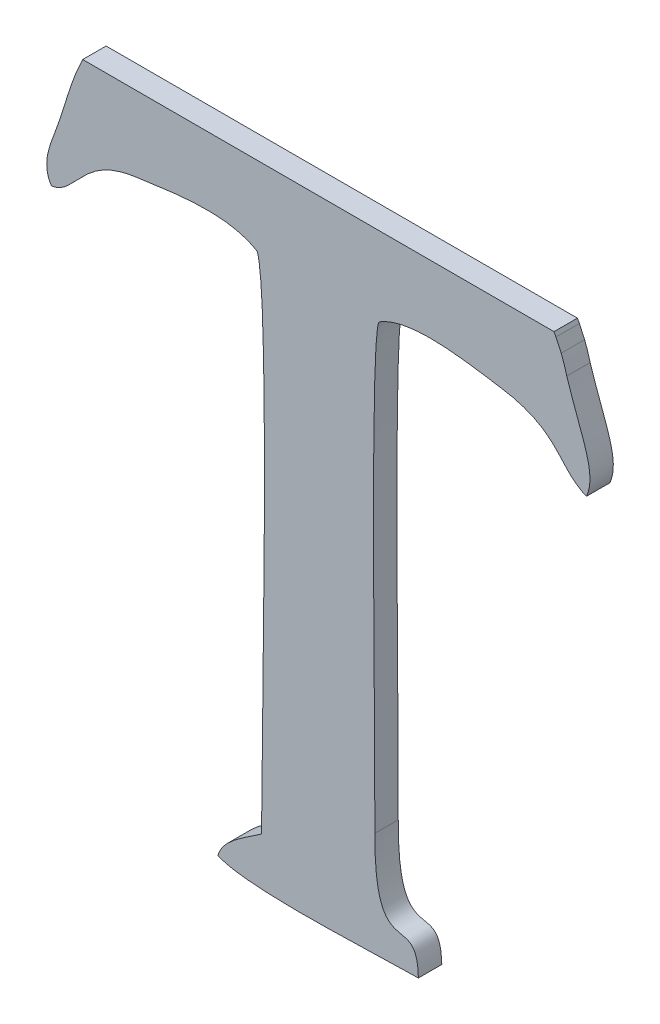
ISO-10303-21;
HEADER;
FILE_DESCRIPTION(('STEP AP214'),'2;1');
FILE_NAME('part.step','',(''),(''),'','','');
FILE_SCHEMA(('AUTOMOTIVE_DESIGN { 1 0 10303 214 1 1 1 1 }'));
ENDSEC;
DATA;
#1=APPLICATION_CONTEXT('core data for automotive mechanical design processes');
#2=APPLICATION_PROTOCOL_DEFINITION('international standard','automotive_design',2000,#1);
#3=PRODUCT_CONTEXT('',#1,'mechanical');
#4=PRODUCT('Part','Part','',(#3));
#5=PRODUCT_RELATED_PRODUCT_CATEGORY('part','',(#4));
#6=PRODUCT_DEFINITION_FORMATION('','',#4);
#7=PRODUCT_DEFINITION_CONTEXT('part definition',#1,'design');
#8=PRODUCT_DEFINITION('design','',#6,#7);
#9=PRODUCT_DEFINITION_SHAPE('','',#8);
#10=(LENGTH_UNIT() NAMED_UNIT(*) SI_UNIT(.MILLI.,.METRE.));
#11=(NAMED_UNIT(*) PLANE_ANGLE_UNIT() SI_UNIT($,.RADIAN.));
#12=(NAMED_UNIT(*) SI_UNIT($,.STERADIAN.) SOLID_ANGLE_UNIT());
#13=UNCERTAINTY_MEASURE_WITH_UNIT(LENGTH_MEASURE(1.E-05),#10,'distance_accuracy_value','');
#14=(GEOMETRIC_REPRESENTATION_CONTEXT(3) GLOBAL_UNCERTAINTY_ASSIGNED_CONTEXT((#13)) GLOBAL_UNIT_ASSIGNED_CONTEXT((#10,
#11,#12)) REPRESENTATION_CONTEXT('',''));
#15=CARTESIAN_POINT('',(0.,0.,0.));
#16=DIRECTION('',(0.,0.,1.));
#17=DIRECTION('',(1.,0.,0.));
#18=AXIS2_PLACEMENT_3D('',#15,#16,#17);
#19=CARTESIAN_POINT('',(50.1140179999998,11.257081,0.001));
#20=CARTESIAN_POINT('',(50.1140179999998,11.257081,0.));
#21=CARTESIAN_POINT('',(50.1135699999998,11.256157,0.001));
#22=CARTESIAN_POINT('',(50.1135699999998,11.256157,0.));
#23=CARTESIAN_POINT('',(50.1133739999998,11.255401,0.001));
#24=CARTESIAN_POINT('',(50.1133739999998,11.255401,0.));
#25=CARTESIAN_POINT('',(50.1130519999998,11.254407,0.001));
#26=CARTESIAN_POINT('',(50.1130519999998,11.254407,0.));
#27=B_SPLINE_SURFACE_WITH_KNOTS('',3,1,((#19,#20),(#21,#22),(#23,#24),(#25,#26)),.UNSPECIFIED.,
.F.,.F.,.F.,(4,4),(2,2),(0.823529411764706,0.882352941176471),(0.,1.),.UNSPECIFIED.);
#28=CARTESIAN_POINT('',(50.1140179999998,11.257081,0.));
#29=CARTESIAN_POINT('',(50.1135699999998,11.256157,0.));
#30=CARTESIAN_POINT('',(50.1133739999998,11.255401,0.));
#31=CARTESIAN_POINT('',(50.1130519999998,11.254407,0.));
#32=B_SPLINE_CURVE_WITH_KNOTS('',3,(#28,#29,#30,#31),.UNSPECIFIED.,.F.,.F.,(4,4),
(0.823529411764706,0.882352941176471),.UNSPECIFIED.);
#33=CARTESIAN_POINT('',(50.1140179999998,11.257081,0.));
#34=VERTEX_POINT('',#33);
#35=CARTESIAN_POINT('',(50.1130519999998,11.254407,0.));
#36=VERTEX_POINT('',#35);
#37=EDGE_CURVE('E11',#34,#36,#32,.T.);
#38=DIRECTION('',(0.,0.,-1.));
#39=VECTOR('',#38,1.);
#40=CARTESIAN_POINT('',(50.1130519999998,11.254407,0.001));
#41=LINE('',#40,#39);
#42=CARTESIAN_POINT('',(50.1130519999998,11.254407,0.001));
#43=VERTEX_POINT('',#42);
#44=EDGE_CURVE('E28',#43,#36,#41,.T.);
#45=CARTESIAN_POINT('',(50.1140179999998,11.257081,0.001));
#46=CARTESIAN_POINT('',(50.1135699999998,11.256157,0.001));
#47=CARTESIAN_POINT('',(50.1133739999998,11.255401,0.001));
#48=CARTESIAN_POINT('',(50.1130519999998,11.254407,0.001));
#49=B_SPLINE_CURVE_WITH_KNOTS('',3,(#45,#46,#47,#48),.UNSPECIFIED.,.F.,.F.,(4,4),
(0.823529411764706,0.882352941176471),.UNSPECIFIED.);
#50=CARTESIAN_POINT('',(50.1140179999998,11.257081,0.001));
#51=VERTEX_POINT('',#50);
#52=EDGE_CURVE('E368',#51,#43,#49,.T.);
#53=DIRECTION('',(0.,0.,-1.));
#54=VECTOR('',#53,1.);
#55=CARTESIAN_POINT('',(50.1140179999998,11.257081,0.001));
#56=LINE('',#55,#54);
#57=EDGE_CURVE('E40',#51,#34,#56,.T.);
#58=ORIENTED_EDGE('',*,*,#37,.T.);
#59=ORIENTED_EDGE('',*,*,#44,.F.);
#60=ORIENTED_EDGE('',*,*,#52,.F.);
#61=ORIENTED_EDGE('',*,*,#57,.T.);
#62=EDGE_LOOP('',(#58,#59,#60,#61));
#63=FACE_BOUND('',#62,.T.);
#64=ADVANCED_FACE('F17',(#63),#27,.F.);
#65=CARTESIAN_POINT('',(50.1130519999998,11.254407,0.001));
#66=CARTESIAN_POINT('',(50.1130519999998,11.254407,0.));
#67=CARTESIAN_POINT('',(50.1127859999998,11.253553,0.001));
#68=CARTESIAN_POINT('',(50.1127859999998,11.253553,0.));
#69=CARTESIAN_POINT('',(50.1121559999998,11.252503,0.001));
#70=CARTESIAN_POINT('',(50.1121559999998,11.252503,0.));
#71=CARTESIAN_POINT('',(50.1126879999998,11.251733,0.001));
#72=CARTESIAN_POINT('',(50.1126879999998,11.251733,0.));
#73=B_SPLINE_SURFACE_WITH_KNOTS('',3,1,((#65,#66),(#67,#68),(#69,#70),(#71,#72)),.UNSPECIFIED.,
.F.,.F.,.F.,(4,4),(2,2),(0.882352941176471,1.),(0.,1.),.UNSPECIFIED.);
#74=CARTESIAN_POINT('',(50.1130519999998,11.254407,0.));
#75=CARTESIAN_POINT('',(50.1127859999998,11.253553,0.));
#76=CARTESIAN_POINT('',(50.1121559999998,11.252503,0.));
#77=CARTESIAN_POINT('',(50.1126879999998,11.251733,0.));
#78=B_SPLINE_CURVE_WITH_KNOTS('',3,(#74,#75,#76,#77),.UNSPECIFIED.,.F.,.F.,(4,4),
(0.882352941176471,1.),.UNSPECIFIED.);
#79=CARTESIAN_POINT('',(50.1126879999998,11.251733,0.));
#80=VERTEX_POINT('',#79);
#81=EDGE_CURVE('E360',#36,#80,#78,.T.);
#82=DIRECTION('',(0.,0.,-1.));
#83=VECTOR('',#82,1.);
#84=CARTESIAN_POINT('',(50.1126879999998,11.251733,0.001));
#85=LINE('',#84,#83);
#86=CARTESIAN_POINT('',(50.1126879999998,11.251733,0.001));
#87=VERTEX_POINT('',#86);
#88=EDGE_CURVE('E355',#87,#80,#85,.T.);
#89=CARTESIAN_POINT('',(50.1130519999998,11.254407,0.001));
#90=CARTESIAN_POINT('',(50.1127859999998,11.253553,0.001));
#91=CARTESIAN_POINT('',(50.1121559999998,11.252503,0.001));
#92=CARTESIAN_POINT('',(50.1126879999998,11.251733,0.001));
#93=B_SPLINE_CURVE_WITH_KNOTS('',3,(#89,#90,#91,#92),.UNSPECIFIED.,.F.,.F.,(4,4),
(0.882352941176471,1.),.UNSPECIFIED.);
#94=EDGE_CURVE('E348',#43,#87,#93,.T.);
#95=ORIENTED_EDGE('',*,*,#81,.T.);
#96=ORIENTED_EDGE('',*,*,#88,.F.);
#97=ORIENTED_EDGE('',*,*,#94,.F.);
#98=ORIENTED_EDGE('',*,*,#44,.T.);
#99=EDGE_LOOP('',(#95,#96,#97,#98));
#100=FACE_BOUND('',#99,.T.);
#101=ADVANCED_FACE('F376',(#100),#73,.F.);
#102=CARTESIAN_POINT('',(50.1126879999998,11.251733,0.001));
#103=CARTESIAN_POINT('',(50.1126879999998,11.251733,0.));
#104=CARTESIAN_POINT('',(50.1137799999998,11.251915,0.001));
#105=CARTESIAN_POINT('',(50.1137799999998,11.251915,0.));
#106=CARTESIAN_POINT('',(50.1139339999998,11.253567,0.001));
#107=CARTESIAN_POINT('',(50.1139339999998,11.253567,0.));
#108=CARTESIAN_POINT('',(50.1163419999998,11.253875,0.001));
#109=CARTESIAN_POINT('',(50.1163419999998,11.253875,0.));
#110=B_SPLINE_SURFACE_WITH_KNOTS('',3,1,((#102,#103),(#104,#105),(#106,#107),(#108,#109)),
.UNSPECIFIED.,.F.,.F.,.F.,(4,4),(2,2),(0.,0.0588235294117647),(0.,1.),.UNSPECIFIED.);
#111=CARTESIAN_POINT('',(50.1126879999998,11.251733,0.));
#112=CARTESIAN_POINT('',(50.1137799999998,11.251915,0.));
#113=CARTESIAN_POINT('',(50.1139339999998,11.253567,0.));
#114=CARTESIAN_POINT('',(50.1163419999998,11.253875,0.));
#115=B_SPLINE_CURVE_WITH_KNOTS('',3,(#111,#112,#113,#114),.UNSPECIFIED.,.F.,.F.,(4,4),(0.,
0.0588235294117647),.UNSPECIFIED.);
#116=CARTESIAN_POINT('',(50.1163419999998,11.253875,0.));
#117=VERTEX_POINT('',#116);
#118=EDGE_CURVE('E343',#80,#117,#115,.T.);
#119=DIRECTION('',(0.,0.,-1.));
#120=VECTOR('',#119,1.);
#121=CARTESIAN_POINT('',(50.1163419999998,11.253875,0.001));
#122=LINE('',#121,#120);
#123=CARTESIAN_POINT('',(50.1163419999998,11.253875,0.001));
#124=VERTEX_POINT('',#123);
#125=EDGE_CURVE('E338',#124,#117,#122,.T.);
#126=CARTESIAN_POINT('',(50.1126879999998,11.251733,0.001));
#127=CARTESIAN_POINT('',(50.1137799999998,11.251915,0.001));
#128=CARTESIAN_POINT('',(50.1139339999998,11.253567,0.001));
#129=CARTESIAN_POINT('',(50.1163419999998,11.253875,0.001));
#130=B_SPLINE_CURVE_WITH_KNOTS('',3,(#126,#127,#128,#129),.UNSPECIFIED.,.F.,.F.,(4,4),(0.,
0.0588235294117647),.UNSPECIFIED.);
#131=EDGE_CURVE('E331',#87,#124,#130,.T.);
#132=ORIENTED_EDGE('',*,*,#118,.T.);
#133=ORIENTED_EDGE('',*,*,#125,.F.);
#134=ORIENTED_EDGE('',*,*,#131,.F.);
#135=ORIENTED_EDGE('',*,*,#88,.T.);
#136=EDGE_LOOP('',(#132,#133,#134,#135));
#137=FACE_BOUND('',#136,.T.);
#138=ADVANCED_FACE('F381',(#137),#110,.F.);
#139=CARTESIAN_POINT('',(50.1163419999998,11.253875,0.000999999999999998));
#140=CARTESIAN_POINT('',(50.1163419999998,11.253875,0.));
#141=CARTESIAN_POINT('',(50.1178819999998,11.254085,0.000999999999999998));
#142=CARTESIAN_POINT('',(50.1178819999998,11.254085,0.));
#143=CARTESIAN_POINT('',(50.1201919999998,11.254505,0.000999999999999998));
#144=CARTESIAN_POINT('',(50.1201919999998,11.254505,0.));
#145=CARTESIAN_POINT('',(50.1214799999998,11.253707,0.000999999999999998));
#146=CARTESIAN_POINT('',(50.1214799999998,11.253707,0.));
#147=B_SPLINE_SURFACE_WITH_KNOTS('',3,1,((#139,#140),(#141,#142),(#143,#144),(#145,#146)),
.UNSPECIFIED.,.F.,.F.,.F.,(4,4),(2,2),(0.0588235294117647,0.117647058823529),(0.,1.),.UNSPECIFIED.);
#148=CARTESIAN_POINT('',(50.1163419999998,11.253875,0.));
#149=CARTESIAN_POINT('',(50.1178819999998,11.254085,0.));
#150=CARTESIAN_POINT('',(50.1201919999998,11.254505,0.));
#151=CARTESIAN_POINT('',(50.1214799999998,11.253707,0.));
#152=B_SPLINE_CURVE_WITH_KNOTS('',3,(#148,#149,#150,#151),.UNSPECIFIED.,.F.,.F.,(4,4),
(0.0588235294117647,0.117647058823529),.UNSPECIFIED.);
#153=CARTESIAN_POINT('',(50.1214799999998,11.253707,0.));
#154=VERTEX_POINT('',#153);
#155=EDGE_CURVE('E326',#117,#154,#152,.T.);
#156=DIRECTION('',(0.,0.,-1.));
#157=VECTOR('',#156,1.);
#158=CARTESIAN_POINT('',(50.1214799999998,11.253707,0.000999999999999998));
#159=LINE('',#158,#157);
#160=CARTESIAN_POINT('',(50.1214799999998,11.253707,0.000999999999999998));
#161=VERTEX_POINT('',#160);
#162=EDGE_CURVE('E321',#161,#154,#159,.T.);
#163=CARTESIAN_POINT('',(50.1163419999998,11.253875,0.001));
#164=CARTESIAN_POINT('',(50.1178819999998,11.254085,0.000999999999999998));
#165=CARTESIAN_POINT('',(50.1201919999998,11.254505,0.000999999999999998));
#166=CARTESIAN_POINT('',(50.1214799999998,11.253707,0.000999999999999998));
#167=B_SPLINE_CURVE_WITH_KNOTS('',3,(#163,#164,#165,#166),.UNSPECIFIED.,.F.,.F.,(4,4),
(0.0588235294117647,0.117647058823529),.UNSPECIFIED.);
#168=EDGE_CURVE('E314',#124,#161,#167,.T.);
#169=ORIENTED_EDGE('',*,*,#155,.T.);
#170=ORIENTED_EDGE('',*,*,#162,.F.);
#171=ORIENTED_EDGE('',*,*,#168,.F.);
#172=ORIENTED_EDGE('',*,*,#125,.T.);
#173=EDGE_LOOP('',(#169,#170,#171,#172));
#174=FACE_BOUND('',#173,.T.);
#175=ADVANCED_FACE('F387',(#174),#147,.F.);
#176=CARTESIAN_POINT('',(50.1214799999998,11.253707,0.001));
#177=CARTESIAN_POINT('',(50.1214799999998,11.253707,0.));
#178=CARTESIAN_POINT('',(50.1220399999998,11.252223,0.001));
#179=CARTESIAN_POINT('',(50.1220399999998,11.252223,0.));
#180=CARTESIAN_POINT('',(50.1216619999998,11.235283,0.001));
#181=CARTESIAN_POINT('',(50.1216619999998,11.235283,0.));
#182=CARTESIAN_POINT('',(50.1216619999998,11.232231,0.001));
#183=CARTESIAN_POINT('',(50.1216619999998,11.232231,0.));
#184=B_SPLINE_SURFACE_WITH_KNOTS('',3,1,((#176,#177),(#178,#179),(#180,#181),(#182,#183)),
.UNSPECIFIED.,.F.,.F.,.F.,(4,4),(2,2),(0.117647058823529,0.176470588235294),(0.,1.),.UNSPECIFIED.);
#185=CARTESIAN_POINT('',(50.1214799999998,11.253707,0.));
#186=CARTESIAN_POINT('',(50.1220399999998,11.252223,0.));
#187=CARTESIAN_POINT('',(50.1216619999998,11.235283,0.));
#188=CARTESIAN_POINT('',(50.1216619999998,11.232231,0.));
#189=B_SPLINE_CURVE_WITH_KNOTS('',3,(#185,#186,#187,#188),.UNSPECIFIED.,.F.,.F.,(4,4),
(0.117647058823529,0.176470588235294),.UNSPECIFIED.);
#190=CARTESIAN_POINT('',(50.1216619999998,11.232231,0.));
#191=VERTEX_POINT('',#190);
#192=EDGE_CURVE('E309',#154,#191,#189,.T.);
#193=DIRECTION('',(0.,0.,-1.));
#194=VECTOR('',#193,1.);
#195=CARTESIAN_POINT('',(50.1216619999998,11.232231,0.001));
#196=LINE('',#195,#194);
#197=CARTESIAN_POINT('',(50.1216619999998,11.232231,0.001));
#198=VERTEX_POINT('',#197);
#199=EDGE_CURVE('E304',#198,#191,#196,.T.);
#200=CARTESIAN_POINT('',(50.1214799999998,11.253707,0.000999999999999998));
#201=CARTESIAN_POINT('',(50.1220399999998,11.252223,0.001));
#202=CARTESIAN_POINT('',(50.1216619999998,11.235283,0.001));
#203=CARTESIAN_POINT('',(50.1216619999998,11.232231,0.001));
#204=B_SPLINE_CURVE_WITH_KNOTS('',3,(#200,#201,#202,#203),.UNSPECIFIED.,.F.,.F.,(4,4),
(0.117647058823529,0.176470588235294),.UNSPECIFIED.);
#205=EDGE_CURVE('E297',#161,#198,#204,.T.);
#206=ORIENTED_EDGE('',*,*,#192,.T.);
#207=ORIENTED_EDGE('',*,*,#199,.F.);
#208=ORIENTED_EDGE('',*,*,#205,.F.);
#209=ORIENTED_EDGE('',*,*,#162,.T.);
#210=EDGE_LOOP('',(#206,#207,#208,#209));
#211=FACE_BOUND('',#210,.T.);
#212=ADVANCED_FACE('F391',(#211),#184,.F.);
#213=CARTESIAN_POINT('',(50.1216619999998,11.232231,0.001));
#214=CARTESIAN_POINT('',(50.1216619999998,11.232231,0.));
#215=CARTESIAN_POINT('',(50.1210319999998,11.231783,0.001));
#216=CARTESIAN_POINT('',(50.1210319999998,11.231783,0.));
#217=CARTESIAN_POINT('',(50.1199959999998,11.231251,0.001));
#218=CARTESIAN_POINT('',(50.1199959999998,11.231251,0.));
#219=CARTESIAN_POINT('',(50.1197999999998,11.230509,0.001));
#220=CARTESIAN_POINT('',(50.1197999999998,11.230509,0.));
#221=B_SPLINE_SURFACE_WITH_KNOTS('',3,1,((#213,#214),(#215,#216),(#217,#218),(#219,#220)),
.UNSPECIFIED.,.F.,.F.,.F.,(4,4),(2,2),(0.176470588235294,0.235294117647059),(0.,1.),.UNSPECIFIED.);
#222=CARTESIAN_POINT('',(50.1216619999998,11.232231,0.));
#223=CARTESIAN_POINT('',(50.1210319999998,11.231783,0.));
#224=CARTESIAN_POINT('',(50.1199959999998,11.231251,0.));
#225=CARTESIAN_POINT('',(50.1197999999998,11.230509,0.));
#226=B_SPLINE_CURVE_WITH_KNOTS('',3,(#222,#223,#224,#225),.UNSPECIFIED.,.F.,.F.,(4,4),
(0.176470588235294,0.235294117647059),.UNSPECIFIED.);
#227=CARTESIAN_POINT('',(50.1197999999998,11.230509,0.));
#228=VERTEX_POINT('',#227);
#229=EDGE_CURVE('E292',#191,#228,#226,.T.);
#230=DIRECTION('',(0.,0.,-1.));
#231=VECTOR('',#230,1.);
#232=CARTESIAN_POINT('',(50.1197999999998,11.230509,0.001));
#233=LINE('',#232,#231);
#234=CARTESIAN_POINT('',(50.1197999999998,11.230509,0.001));
#235=VERTEX_POINT('',#234);
#236=EDGE_CURVE('E287',#235,#228,#233,.T.);
#237=CARTESIAN_POINT('',(50.1216619999998,11.232231,0.001));
#238=CARTESIAN_POINT('',(50.1210319999998,11.231783,0.001));
#239=CARTESIAN_POINT('',(50.1199959999998,11.231251,0.001));
#240=CARTESIAN_POINT('',(50.1197999999998,11.230509,0.001));
#241=B_SPLINE_CURVE_WITH_KNOTS('',3,(#237,#238,#239,#240),.UNSPECIFIED.,.F.,.F.,(4,4),
(0.176470588235294,0.235294117647059),.UNSPECIFIED.);
#242=EDGE_CURVE('E280',#198,#235,#241,.T.);
#243=ORIENTED_EDGE('',*,*,#229,.T.);
#244=ORIENTED_EDGE('',*,*,#236,.F.);
#245=ORIENTED_EDGE('',*,*,#242,.F.);
#246=ORIENTED_EDGE('',*,*,#199,.T.);
#247=EDGE_LOOP('',(#243,#244,#245,#246));
#248=FACE_BOUND('',#247,.T.);
#249=ADVANCED_FACE('F396',(#248),#221,.F.);
#250=CARTESIAN_POINT('',(50.1197999999998,11.230509,0.001));
#251=CARTESIAN_POINT('',(50.1197999999998,11.230509,0.));
#252=CARTESIAN_POINT('',(50.1210599999998,11.229893,0.001));
#253=CARTESIAN_POINT('',(50.1210599999998,11.229893,0.));
#254=CARTESIAN_POINT('',(50.1266039999998,11.230257,0.001));
#255=CARTESIAN_POINT('',(50.1266039999998,11.230257,0.));
#256=CARTESIAN_POINT('',(50.1283679999998,11.230257,0.001));
#257=CARTESIAN_POINT('',(50.1283679999998,11.230257,0.));
#258=B_SPLINE_SURFACE_WITH_KNOTS('',3,1,((#250,#251),(#252,#253),(#254,#255),(#256,#257)),
.UNSPECIFIED.,.F.,.F.,.F.,(4,4),(2,2),(0.235294117647059,0.294117647058823),(0.,1.),.UNSPECIFIED.);
#259=CARTESIAN_POINT('',(50.1197999999998,11.230509,0.));
#260=CARTESIAN_POINT('',(50.1210599999998,11.229893,0.));
#261=CARTESIAN_POINT('',(50.1266039999998,11.230257,0.));
#262=CARTESIAN_POINT('',(50.1283679999998,11.230257,0.));
#263=B_SPLINE_CURVE_WITH_KNOTS('',3,(#259,#260,#261,#262),.UNSPECIFIED.,.F.,.F.,(4,4),
(0.235294117647059,0.294117647058823),.UNSPECIFIED.);
#264=CARTESIAN_POINT('',(50.1283679999998,11.230257,0.));
#265=VERTEX_POINT('',#264);
#266=EDGE_CURVE('E275',#228,#265,#263,.T.);
#267=DIRECTION('',(0.,0.,-1.));
#268=VECTOR('',#267,1.);
#269=CARTESIAN_POINT('',(50.1283679999998,11.230257,0.001));
#270=LINE('',#269,#268);
#271=CARTESIAN_POINT('',(50.1283679999998,11.230257,0.001));
#272=VERTEX_POINT('',#271);
#273=EDGE_CURVE('E270',#272,#265,#270,.T.);
#274=CARTESIAN_POINT('',(50.1197999999998,11.230509,0.001));
#275=CARTESIAN_POINT('',(50.1210599999998,11.229893,0.001));
#276=CARTESIAN_POINT('',(50.1266039999998,11.230257,0.001));
#277=CARTESIAN_POINT('',(50.1283679999998,11.230257,0.001));
#278=B_SPLINE_CURVE_WITH_KNOTS('',3,(#274,#275,#276,#277),.UNSPECIFIED.,.F.,.F.,(4,4),
(0.235294117647059,0.294117647058823),.UNSPECIFIED.);
#279=EDGE_CURVE('E263',#235,#272,#278,.T.);
#280=ORIENTED_EDGE('',*,*,#266,.T.);
#281=ORIENTED_EDGE('',*,*,#273,.F.);
#282=ORIENTED_EDGE('',*,*,#279,.F.);
#283=ORIENTED_EDGE('',*,*,#236,.T.);
#284=EDGE_LOOP('',(#280,#281,#282,#283));
#285=FACE_BOUND('',#284,.T.);
#286=ADVANCED_FACE('F402',(#285),#258,.F.);
#287=CARTESIAN_POINT('',(50.1283679999998,11.230257,0.001));
#288=CARTESIAN_POINT('',(50.1283679999998,11.230257,0.));
#289=CARTESIAN_POINT('',(50.1283119999998,11.232875,0.001));
#290=CARTESIAN_POINT('',(50.1283119999998,11.232875,0.));
#291=CARTESIAN_POINT('',(50.1264779999998,11.229669,0.001));
#292=CARTESIAN_POINT('',(50.1264779999998,11.229669,0.));
#293=CARTESIAN_POINT('',(50.1265059999998,11.234681,0.001));
#294=CARTESIAN_POINT('',(50.1265059999998,11.234681,0.));
#295=B_SPLINE_SURFACE_WITH_KNOTS('',3,1,((#287,#288),(#289,#290),(#291,#292),(#293,#294)),
.UNSPECIFIED.,.F.,.F.,.F.,(4,4),(2,2),(0.294117647058823,0.352941176470588),(0.,1.),.UNSPECIFIED.);
#296=CARTESIAN_POINT('',(50.1283679999998,11.230257,0.));
#297=CARTESIAN_POINT('',(50.1283119999998,11.232875,0.));
#298=CARTESIAN_POINT('',(50.1264779999998,11.229669,0.));
#299=CARTESIAN_POINT('',(50.1265059999998,11.234681,0.));
#300=B_SPLINE_CURVE_WITH_KNOTS('',3,(#296,#297,#298,#299),.UNSPECIFIED.,.F.,.F.,(4,4),
(0.294117647058823,0.352941176470588),.UNSPECIFIED.);
#301=CARTESIAN_POINT('',(50.1265059999998,11.234681,0.));
#302=VERTEX_POINT('',#301);
#303=EDGE_CURVE('E258',#265,#302,#300,.T.);
#304=DIRECTION('',(0.,0.,-1.));
#305=VECTOR('',#304,1.);
#306=CARTESIAN_POINT('',(50.1265059999998,11.234681,0.001));
#307=LINE('',#306,#305);
#308=CARTESIAN_POINT('',(50.1265059999998,11.234681,0.001));
#309=VERTEX_POINT('',#308);
#310=EDGE_CURVE('E253',#309,#302,#307,.T.);
#311=CARTESIAN_POINT('',(50.1283679999998,11.230257,0.001));
#312=CARTESIAN_POINT('',(50.1283119999998,11.232875,0.001));
#313=CARTESIAN_POINT('',(50.1264779999998,11.229669,0.001));
#314=CARTESIAN_POINT('',(50.1265059999998,11.234681,0.001));
#315=B_SPLINE_CURVE_WITH_KNOTS('',3,(#311,#312,#313,#314),.UNSPECIFIED.,.F.,.F.,(4,4),
(0.294117647058823,0.352941176470588),.UNSPECIFIED.);
#316=EDGE_CURVE('E246',#272,#309,#315,.T.);
#317=ORIENTED_EDGE('',*,*,#303,.T.);
#318=ORIENTED_EDGE('',*,*,#310,.F.);
#319=ORIENTED_EDGE('',*,*,#316,.F.);
#320=ORIENTED_EDGE('',*,*,#273,.T.);
#321=EDGE_LOOP('',(#317,#318,#319,#320));
#322=FACE_BOUND('',#321,.T.);
#323=ADVANCED_FACE('F406',(#322),#295,.F.);
#324=CARTESIAN_POINT('',(50.1265059999998,11.234681,0.001));
#325=CARTESIAN_POINT('',(50.1265059999998,11.234681,0.));
#326=CARTESIAN_POINT('',(50.1265339999998,11.237579,0.001));
#327=CARTESIAN_POINT('',(50.1265339999998,11.237579,0.));
#328=CARTESIAN_POINT('',(50.1262679999998,11.253175,0.001));
#329=CARTESIAN_POINT('',(50.1262679999998,11.253175,0.));
#330=CARTESIAN_POINT('',(50.1266879999998,11.253707,0.001));
#331=CARTESIAN_POINT('',(50.1266879999998,11.253707,0.));
#332=B_SPLINE_SURFACE_WITH_KNOTS('',3,1,((#324,#325),(#326,#327),(#328,#329),(#330,#331)),
.UNSPECIFIED.,.F.,.F.,.F.,(4,4),(2,2),(0.352941176470588,0.411764705882353),(0.,1.),.UNSPECIFIED.);
#333=CARTESIAN_POINT('',(50.1265059999998,11.234681,0.));
#334=CARTESIAN_POINT('',(50.1265339999998,11.237579,0.));
#335=CARTESIAN_POINT('',(50.1262679999998,11.253175,0.));
#336=CARTESIAN_POINT('',(50.1266879999998,11.253707,0.));
#337=B_SPLINE_CURVE_WITH_KNOTS('',3,(#333,#334,#335,#336),.UNSPECIFIED.,.F.,.F.,(4,4),
(0.352941176470588,0.411764705882353),.UNSPECIFIED.);
#338=CARTESIAN_POINT('',(50.1266879999998,11.253707,0.));
#339=VERTEX_POINT('',#338);
#340=EDGE_CURVE('E241',#302,#339,#337,.T.);
#341=DIRECTION('',(0.,0.,-1.));
#342=VECTOR('',#341,1.);
#343=CARTESIAN_POINT('',(50.1266879999998,11.253707,0.001));
#344=LINE('',#343,#342);
#345=CARTESIAN_POINT('',(50.1266879999998,11.253707,0.001));
#346=VERTEX_POINT('',#345);
#347=EDGE_CURVE('E236',#346,#339,#344,.T.);
#348=CARTESIAN_POINT('',(50.1265059999998,11.234681,0.001));
#349=CARTESIAN_POINT('',(50.1265339999998,11.237579,0.001));
#350=CARTESIAN_POINT('',(50.1262679999998,11.253175,0.001));
#351=CARTESIAN_POINT('',(50.1266879999998,11.253707,0.001));
#352=B_SPLINE_CURVE_WITH_KNOTS('',3,(#348,#349,#350,#351),.UNSPECIFIED.,.F.,.F.,(4,4),
(0.352941176470588,0.411764705882353),.UNSPECIFIED.);
#353=EDGE_CURVE('E229',#309,#346,#352,.T.);
#354=ORIENTED_EDGE('',*,*,#340,.T.);
#355=ORIENTED_EDGE('',*,*,#347,.F.);
#356=ORIENTED_EDGE('',*,*,#353,.F.);
#357=ORIENTED_EDGE('',*,*,#310,.T.);
#358=EDGE_LOOP('',(#354,#355,#356,#357));
#359=FACE_BOUND('',#358,.T.);
#360=ADVANCED_FACE('F411',(#359),#332,.F.);
#361=CARTESIAN_POINT('',(50.1266879999998,11.253707,0.000999999999999998));
#362=CARTESIAN_POINT('',(50.1266879999998,11.253707,0.));
#363=CARTESIAN_POINT('',(50.1280319999998,11.254533,0.000999999999999998));
#364=CARTESIAN_POINT('',(50.1280319999998,11.254533,0.));
#365=CARTESIAN_POINT('',(50.1302859999998,11.254113,0.000999999999999998));
#366=CARTESIAN_POINT('',(50.1302859999998,11.254113,0.));
#367=CARTESIAN_POINT('',(50.1318399999998,11.253875,0.000999999999999998));
#368=CARTESIAN_POINT('',(50.1318399999998,11.253875,0.));
#369=B_SPLINE_SURFACE_WITH_KNOTS('',3,1,((#361,#362),(#363,#364),(#365,#366),(#367,#368)),
.UNSPECIFIED.,.F.,.F.,.F.,(4,4),(2,2),(0.411764705882353,0.470588235294118),(0.,1.),.UNSPECIFIED.);
#370=CARTESIAN_POINT('',(50.1266879999998,11.253707,0.));
#371=CARTESIAN_POINT('',(50.1280319999998,11.254533,0.));
#372=CARTESIAN_POINT('',(50.1302859999998,11.254113,0.));
#373=CARTESIAN_POINT('',(50.1318399999998,11.253875,0.));
#374=B_SPLINE_CURVE_WITH_KNOTS('',3,(#370,#371,#372,#373),.UNSPECIFIED.,.F.,.F.,(4,4),
(0.411764705882353,0.470588235294118),.UNSPECIFIED.);
#375=CARTESIAN_POINT('',(50.1318399999998,11.253875,0.));
#376=VERTEX_POINT('',#375);
#377=EDGE_CURVE('E224',#339,#376,#374,.T.);
#378=DIRECTION('',(0.,0.,-1.));
#379=VECTOR('',#378,1.);
#380=CARTESIAN_POINT('',(50.1318399999998,11.253875,0.000999999999999998));
#381=LINE('',#380,#379);
#382=CARTESIAN_POINT('',(50.1318399999998,11.253875,0.000999999999999998));
#383=VERTEX_POINT('',#382);
#384=EDGE_CURVE('E219',#383,#376,#381,.T.);
#385=CARTESIAN_POINT('',(50.1266879999998,11.253707,0.001));
#386=CARTESIAN_POINT('',(50.1280319999998,11.254533,0.000999999999999998));
#387=CARTESIAN_POINT('',(50.1302859999998,11.254113,0.000999999999999998));
#388=CARTESIAN_POINT('',(50.1318399999998,11.253875,0.000999999999999998));
#389=B_SPLINE_CURVE_WITH_KNOTS('',3,(#385,#386,#387,#388),.UNSPECIFIED.,.F.,.F.,(4,4),
(0.411764705882353,0.470588235294118),.UNSPECIFIED.);
#390=EDGE_CURVE('E212',#346,#383,#389,.T.);
#391=ORIENTED_EDGE('',*,*,#377,.T.);
#392=ORIENTED_EDGE('',*,*,#384,.F.);
#393=ORIENTED_EDGE('',*,*,#390,.F.);
#394=ORIENTED_EDGE('',*,*,#347,.T.);
#395=EDGE_LOOP('',(#391,#392,#393,#394));
#396=FACE_BOUND('',#395,.T.);
#397=ADVANCED_FACE('F417',(#396),#369,.F.);
#398=CARTESIAN_POINT('',(50.1318399999998,11.253875,0.001));
#399=CARTESIAN_POINT('',(50.1318399999998,11.253875,0.));
#400=CARTESIAN_POINT('',(50.1344439999998,11.253497,0.001));
#401=CARTESIAN_POINT('',(50.1344439999998,11.253497,0.));
#402=CARTESIAN_POINT('',(50.1343039999998,11.252181,0.001));
#403=CARTESIAN_POINT('',(50.1343039999998,11.252181,0.));
#404=CARTESIAN_POINT('',(50.1355499999998,11.251677,0.001));
#405=CARTESIAN_POINT('',(50.1355499999998,11.251677,0.));
#406=B_SPLINE_SURFACE_WITH_KNOTS('',3,1,((#398,#399),(#400,#401),(#402,#403),(#404,#405)),
.UNSPECIFIED.,.F.,.F.,.F.,(4,4),(2,2),(0.470588235294118,0.529411764705882),(0.,1.),.UNSPECIFIED.);
#407=CARTESIAN_POINT('',(50.1318399999998,11.253875,0.));
#408=CARTESIAN_POINT('',(50.1344439999998,11.253497,0.));
#409=CARTESIAN_POINT('',(50.1343039999998,11.252181,0.));
#410=CARTESIAN_POINT('',(50.1355499999998,11.251677,0.));
#411=B_SPLINE_CURVE_WITH_KNOTS('',3,(#407,#408,#409,#410),.UNSPECIFIED.,.F.,.F.,(4,4),
(0.470588235294118,0.529411764705882),.UNSPECIFIED.);
#412=CARTESIAN_POINT('',(50.1355499999998,11.251677,0.));
#413=VERTEX_POINT('',#412);
#414=EDGE_CURVE('E207',#376,#413,#411,.T.);
#415=DIRECTION('',(0.,0.,-1.));
#416=VECTOR('',#415,1.);
#417=CARTESIAN_POINT('',(50.1355499999998,11.251677,0.001));
#418=LINE('',#417,#416);
#419=CARTESIAN_POINT('',(50.1355499999998,11.251677,0.001));
#420=VERTEX_POINT('',#419);
#421=EDGE_CURVE('E202',#420,#413,#418,.T.);
#422=CARTESIAN_POINT('',(50.1318399999998,11.253875,0.000999999999999998));
#423=CARTESIAN_POINT('',(50.1344439999998,11.253497,0.001));
#424=CARTESIAN_POINT('',(50.1343039999998,11.252181,0.001));
#425=CARTESIAN_POINT('',(50.1355499999998,11.251677,0.001));
#426=B_SPLINE_CURVE_WITH_KNOTS('',3,(#422,#423,#424,#425),.UNSPECIFIED.,.F.,.F.,(4,4),
(0.470588235294118,0.529411764705882),.UNSPECIFIED.);
#427=EDGE_CURVE('E195',#383,#420,#426,.T.);
#428=ORIENTED_EDGE('',*,*,#414,.T.);
#429=ORIENTED_EDGE('',*,*,#421,.F.);
#430=ORIENTED_EDGE('',*,*,#427,.F.);
#431=ORIENTED_EDGE('',*,*,#384,.T.);
#432=EDGE_LOOP('',(#428,#429,#430,#431));
#433=FACE_BOUND('',#432,.T.);
#434=ADVANCED_FACE('F421',(#433),#406,.F.);
#435=CARTESIAN_POINT('',(50.1355499999998,11.251677,0.001));
#436=CARTESIAN_POINT('',(50.1355499999998,11.251677,0.));
#437=CARTESIAN_POINT('',(50.1360119999998,11.252727,0.001));
#438=CARTESIAN_POINT('',(50.1360119999998,11.252727,0.));
#439=CARTESIAN_POINT('',(50.1352979999998,11.253819,0.001));
#440=CARTESIAN_POINT('',(50.1352979999998,11.253819,0.));
#441=CARTESIAN_POINT('',(50.1347099999998,11.255709,0.001));
#442=CARTESIAN_POINT('',(50.1347099999998,11.255709,0.));
#443=B_SPLINE_SURFACE_WITH_KNOTS('',3,1,((#435,#436),(#437,#438),(#439,#440),(#441,#442)),
.UNSPECIFIED.,.F.,.F.,.F.,(4,4),(2,2),(0.529411764705882,0.588235294117647),(0.,1.),.UNSPECIFIED.);
#444=CARTESIAN_POINT('',(50.1355499999998,11.251677,0.));
#445=CARTESIAN_POINT('',(50.1360119999998,11.252727,0.));
#446=CARTESIAN_POINT('',(50.1352979999998,11.253819,0.));
#447=CARTESIAN_POINT('',(50.1347099999998,11.255709,0.));
#448=B_SPLINE_CURVE_WITH_KNOTS('',3,(#444,#445,#446,#447),.UNSPECIFIED.,.F.,.F.,(4,4),
(0.529411764705882,0.588235294117647),.UNSPECIFIED.);
#449=CARTESIAN_POINT('',(50.1347099999998,11.255709,0.));
#450=VERTEX_POINT('',#449);
#451=EDGE_CURVE('E190',#413,#450,#448,.T.);
#452=DIRECTION('',(0.,0.,-1.));
#453=VECTOR('',#452,1.);
#454=CARTESIAN_POINT('',(50.1347099999998,11.255709,0.001));
#455=LINE('',#454,#453);
#456=CARTESIAN_POINT('',(50.1347099999998,11.255709,0.001));
#457=VERTEX_POINT('',#456);
#458=EDGE_CURVE('E185',#457,#450,#455,.T.);
#459=CARTESIAN_POINT('',(50.1355499999998,11.251677,0.001));
#460=CARTESIAN_POINT('',(50.1360119999998,11.252727,0.001));
#461=CARTESIAN_POINT('',(50.1352979999998,11.253819,0.001));
#462=CARTESIAN_POINT('',(50.1347099999998,11.255709,0.001));
#463=B_SPLINE_CURVE_WITH_KNOTS('',3,(#459,#460,#461,#462),.UNSPECIFIED.,.F.,.F.,(4,4),
(0.529411764705882,0.588235294117647),.UNSPECIFIED.);
#464=EDGE_CURVE('E178',#420,#457,#463,.T.);
#465=ORIENTED_EDGE('',*,*,#451,.T.);
#466=ORIENTED_EDGE('',*,*,#458,.F.);
#467=ORIENTED_EDGE('',*,*,#464,.F.);
#468=ORIENTED_EDGE('',*,*,#421,.T.);
#469=EDGE_LOOP('',(#465,#466,#467,#468));
#470=FACE_BOUND('',#469,.T.);
#471=ADVANCED_FACE('F426',(#470),#443,.F.);
#472=CARTESIAN_POINT('',(50.1347099999998,11.255709,0.001));
#473=CARTESIAN_POINT('',(50.1347099999998,11.255709,0.));
#474=CARTESIAN_POINT('',(50.1346399999998,11.255947,0.001));
#475=CARTESIAN_POINT('',(50.1346399999998,11.255947,0.));
#476=CARTESIAN_POINT('',(50.1345839999998,11.256171,0.001));
#477=CARTESIAN_POINT('',(50.1345839999998,11.256171,0.));
#478=CARTESIAN_POINT('',(50.1344719999998,11.256437,0.001));
#479=CARTESIAN_POINT('',(50.1344719999998,11.256437,0.));
#480=B_SPLINE_SURFACE_WITH_KNOTS('',3,1,((#472,#473),(#474,#475),(#476,#477),(#478,#479)),
.UNSPECIFIED.,.F.,.F.,.F.,(4,4),(2,2),(0.588235294117647,0.647058823529412),(0.,1.),.UNSPECIFIED.);
#481=CARTESIAN_POINT('',(50.1347099999998,11.255709,0.));
#482=CARTESIAN_POINT('',(50.1346399999998,11.255947,0.));
#483=CARTESIAN_POINT('',(50.1345839999998,11.256171,0.));
#484=CARTESIAN_POINT('',(50.1344719999998,11.256437,0.));
#485=B_SPLINE_CURVE_WITH_KNOTS('',3,(#481,#482,#483,#484),.UNSPECIFIED.,.F.,.F.,(4,4),
(0.588235294117647,0.647058823529412),.UNSPECIFIED.);
#486=CARTESIAN_POINT('',(50.1344719999998,11.256437,0.));
#487=VERTEX_POINT('',#486);
#488=EDGE_CURVE('E173',#450,#487,#485,.T.);
#489=DIRECTION('',(0.,0.,-1.));
#490=VECTOR('',#489,1.);
#491=CARTESIAN_POINT('',(50.1344719999998,11.256437,0.001));
#492=LINE('',#491,#490);
#493=CARTESIAN_POINT('',(50.1344719999998,11.256437,0.001));
#494=VERTEX_POINT('',#493);
#495=EDGE_CURVE('E168',#494,#487,#492,.T.);
#496=CARTESIAN_POINT('',(50.1347099999998,11.255709,0.001));
#497=CARTESIAN_POINT('',(50.1346399999998,11.255947,0.001));
#498=CARTESIAN_POINT('',(50.1345839999998,11.256171,0.001));
#499=CARTESIAN_POINT('',(50.1344719999998,11.256437,0.001));
#500=B_SPLINE_CURVE_WITH_KNOTS('',3,(#496,#497,#498,#499),.UNSPECIFIED.,.F.,.F.,(4,4),
(0.588235294117647,0.647058823529412),.UNSPECIFIED.);
#501=EDGE_CURVE('E164',#457,#494,#500,.T.);
#502=ORIENTED_EDGE('',*,*,#488,.T.);
#503=ORIENTED_EDGE('',*,*,#495,.F.);
#504=ORIENTED_EDGE('',*,*,#501,.F.);
#505=ORIENTED_EDGE('',*,*,#458,.T.);
#506=EDGE_LOOP('',(#502,#503,#504,#505));
#507=FACE_BOUND('',#506,.T.);
#508=ADVANCED_FACE('F430',(#507),#480,.F.);
#509=CARTESIAN_POINT('',(45.7247352598469,20.9027361189907,0.001));
#510=DIRECTION('',(-0.90947447558427,-0.415759760271142,0.));
#511=DIRECTION('',(0.415759760271142,-0.90947447558427,0.));
#512=AXIS2_PLACEMENT_3D('',#509,#510,#511);
#513=PLANE('',#512);
#514=DIRECTION('',(-0.415759760271142,0.90947447558427,0.));
#515=VECTOR('',#514,1.);
#516=CARTESIAN_POINT('',(45.7247352598469,20.9027361189907,0.));
#517=LINE('',#516,#515);
#518=CARTESIAN_POINT('',(50.1342479999998,11.256927,0.));
#519=VERTEX_POINT('',#518);
#520=EDGE_CURVE('E162',#487,#519,#517,.T.);
#521=ORIENTED_EDGE('',*,*,#520,.T.);
#522=DIRECTION('',(0.,0.,-1.));
#523=VECTOR('',#522,1.);
#524=CARTESIAN_POINT('',(50.1342479999998,11.256927,0.001));
#525=LINE('',#524,#523);
#526=CARTESIAN_POINT('',(50.1342479999998,11.256927,0.001));
#527=VERTEX_POINT('',#526);
#528=EDGE_CURVE('E160',#527,#519,#525,.T.);
#529=ORIENTED_EDGE('',*,*,#528,.F.);
#530=DIRECTION('',(-0.415759760271142,0.90947447558427,0.));
#531=VECTOR('',#530,1.);
#532=CARTESIAN_POINT('',(45.7247352598469,20.9027361189907,0.001));
#533=LINE('',#532,#531);
#534=EDGE_CURVE('E151',#494,#527,#533,.T.);
#535=ORIENTED_EDGE('',*,*,#534,.F.);
#536=ORIENTED_EDGE('',*,*,#495,.T.);
#537=EDGE_LOOP('',(#521,#529,#535,#536));
#538=FACE_BOUND('',#537,.T.);
#539=ADVANCED_FACE('F434',(#538),#513,.F.);
#540=CARTESIAN_POINT('',(43.3707082184954,23.656749934341,0.001));
#541=DIRECTION('',(-0.877895572940083,-0.478852130633459,0.));
#542=DIRECTION('',(0.478852130633459,-0.877895572940083,0.));
#543=AXIS2_PLACEMENT_3D('',#540,#541,#542);
#544=PLANE('',#543);
#545=DIRECTION('',(-0.478852130633459,0.877895572940083,0.));
#546=VECTOR('',#545,1.);
#547=CARTESIAN_POINT('',(43.3707082184954,23.656749934341,0.));
#548=LINE('',#547,#546);
#549=CARTESIAN_POINT('',(50.1341639999998,11.257081,0.));
#550=VERTEX_POINT('',#549);
#551=EDGE_CURVE('E139',#519,#550,#548,.T.);
#552=ORIENTED_EDGE('',*,*,#551,.T.);
#553=DIRECTION('',(0.,0.,-1.));
#554=VECTOR('',#553,1.);
#555=CARTESIAN_POINT('',(50.1341639999998,11.257081,0.001));
#556=LINE('',#555,#554);
#557=CARTESIAN_POINT('',(50.1341639999998,11.257081,0.001));
#558=VERTEX_POINT('',#557);
#559=EDGE_CURVE('E133',#558,#550,#556,.T.);
#560=ORIENTED_EDGE('',*,*,#559,.F.);
#561=DIRECTION('',(-0.478852130633459,0.877895572940083,0.));
#562=VECTOR('',#561,1.);
#563=CARTESIAN_POINT('',(43.3707082184954,23.656749934341,0.001));
#564=LINE('',#563,#562);
#565=EDGE_CURVE('E137',#527,#558,#564,.T.);
#566=ORIENTED_EDGE('',*,*,#565,.F.);
#567=ORIENTED_EDGE('',*,*,#528,.T.);
#568=EDGE_LOOP('',(#552,#560,#566,#567));
#569=FACE_BOUND('',#568,.T.);
#570=ADVANCED_FACE('F135',(#569),#544,.F.);
#571=CARTESIAN_POINT('',(0.,11.257081,0.001));
#572=DIRECTION('',(0.,-1.,0.));
#573=DIRECTION('',(0.,0.,-1.));
#574=AXIS2_PLACEMENT_3D('',#571,#572,#573);
#575=PLANE('',#574);
#576=DIRECTION('',(-1.,0.,0.));
#577=VECTOR('',#576,1.);
#578=CARTESIAN_POINT('',(0.,11.257081,0.));
#579=LINE('',#578,#577);
#580=EDGE_CURVE('E152',#550,#34,#579,.T.);
#581=ORIENTED_EDGE('',*,*,#580,.T.);
#582=ORIENTED_EDGE('',*,*,#57,.F.);
#583=DIRECTION('',(-1.,0.,0.));
#584=VECTOR('',#583,1.);
#585=CARTESIAN_POINT('',(0.,11.257081,0.001));
#586=LINE('',#585,#584);
#587=EDGE_CURVE('E149',#558,#51,#586,.T.);
#588=ORIENTED_EDGE('',*,*,#587,.F.);
#589=ORIENTED_EDGE('',*,*,#559,.T.);
#590=EDGE_LOOP('',(#581,#582,#588,#589));
#591=FACE_BOUND('',#590,.T.);
#592=ADVANCED_FACE('F154',(#591),#575,.F.);
#593=CARTESIAN_POINT('',(0.,0.,0.001));
#594=DIRECTION('',(0.,0.,1.));
#595=DIRECTION('',(1.,0.,0.));
#596=AXIS2_PLACEMENT_3D('',#593,#594,#595);
#597=PLANE('',#596);
#598=ORIENTED_EDGE('',*,*,#52,.T.);
#599=ORIENTED_EDGE('',*,*,#94,.T.);
#600=ORIENTED_EDGE('',*,*,#131,.T.);
#601=ORIENTED_EDGE('',*,*,#168,.T.);
#602=ORIENTED_EDGE('',*,*,#205,.T.);
#603=ORIENTED_EDGE('',*,*,#242,.T.);
#604=ORIENTED_EDGE('',*,*,#279,.T.);
#605=ORIENTED_EDGE('',*,*,#316,.T.);
#606=ORIENTED_EDGE('',*,*,#353,.T.);
#607=ORIENTED_EDGE('',*,*,#390,.T.);
#608=ORIENTED_EDGE('',*,*,#427,.T.);
#609=ORIENTED_EDGE('',*,*,#464,.T.);
#610=ORIENTED_EDGE('',*,*,#501,.T.);
#611=ORIENTED_EDGE('',*,*,#534,.T.);
#612=ORIENTED_EDGE('',*,*,#565,.T.);
#613=ORIENTED_EDGE('',*,*,#587,.T.);
#614=EDGE_LOOP('',(#598,#599,#600,#601,#602,#603,#604,#605,#606,#607,#608,#609,#610,#611,#612,#613));
#615=FACE_BOUND('',#614,.T.);
#616=ADVANCED_FACE('F148',(#615),#597,.T.);
#617=CARTESIAN_POINT('',(0.,0.,0.));
#618=DIRECTION('',(0.,0.,1.));
#619=DIRECTION('',(1.,0.,0.));
#620=AXIS2_PLACEMENT_3D('',#617,#618,#619);
#621=PLANE('',#620);
#622=ORIENTED_EDGE('',*,*,#37,.F.);
#623=ORIENTED_EDGE('',*,*,#580,.F.);
#624=ORIENTED_EDGE('',*,*,#551,.F.);
#625=ORIENTED_EDGE('',*,*,#520,.F.);
#626=ORIENTED_EDGE('',*,*,#488,.F.);
#627=ORIENTED_EDGE('',*,*,#451,.F.);
#628=ORIENTED_EDGE('',*,*,#414,.F.);
#629=ORIENTED_EDGE('',*,*,#377,.F.);
#630=ORIENTED_EDGE('',*,*,#340,.F.);
#631=ORIENTED_EDGE('',*,*,#303,.F.);
#632=ORIENTED_EDGE('',*,*,#266,.F.);
#633=ORIENTED_EDGE('',*,*,#229,.F.);
#634=ORIENTED_EDGE('',*,*,#192,.F.);
#635=ORIENTED_EDGE('',*,*,#155,.F.);
#636=ORIENTED_EDGE('',*,*,#118,.F.);
#637=ORIENTED_EDGE('',*,*,#81,.F.);
#638=EDGE_LOOP('',(#622,#623,#624,#625,#626,#627,#628,#629,#630,#631,#632,#633,#634,#635,#636,#637));
#639=FACE_BOUND('',#638,.T.);
#640=ADVANCED_FACE('F436',(#639),#621,.F.);
#641=CLOSED_SHELL('',(#64,#101,#138,#175,#212,#249,#286,#323,#360,#397,#434,#471,#508,#539,#570,
#592,#616,#640));
#642=MANIFOLD_SOLID_BREP('B1',#641);
#643=ADVANCED_BREP_SHAPE_REPRESENTATION('',(#18,#642),#14);
#644=SHAPE_DEFINITION_REPRESENTATION(#9,#643);
ENDSEC;
END-ISO-10303-21;
